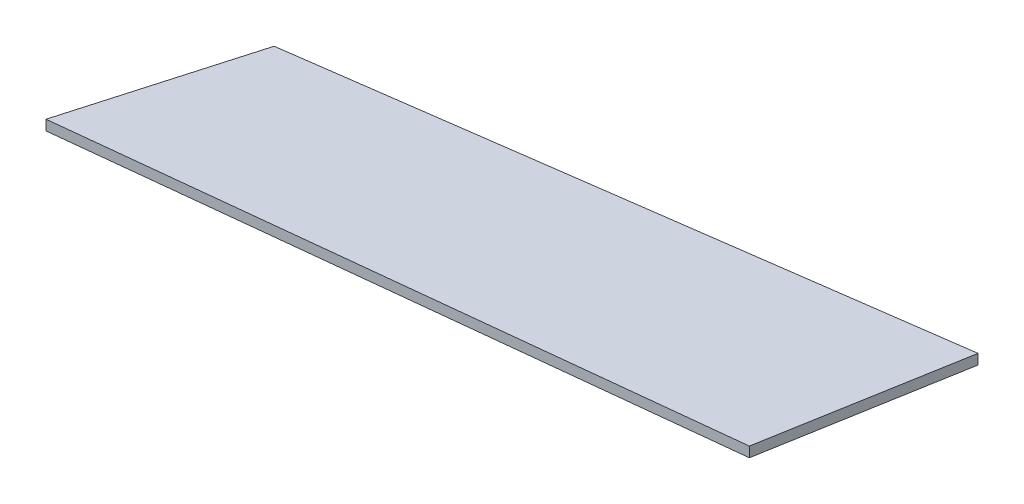
ISO-10303-21;
HEADER;
FILE_DESCRIPTION(('STEP AP214'),'2;1');
FILE_NAME('part.step','',(''),(''),'','','');
FILE_SCHEMA(('AUTOMOTIVE_DESIGN { 1 0 10303 214 1 1 1 1 }'));
ENDSEC;
DATA;
#1=APPLICATION_CONTEXT('core data for automotive mechanical design processes');
#2=APPLICATION_PROTOCOL_DEFINITION('international standard','automotive_design',2000,#1);
#3=PRODUCT_CONTEXT('',#1,'mechanical');
#4=PRODUCT('Part','Part','',(#3));
#5=PRODUCT_RELATED_PRODUCT_CATEGORY('part','',(#4));
#6=PRODUCT_DEFINITION_FORMATION('','',#4);
#7=PRODUCT_DEFINITION_CONTEXT('part definition',#1,'design');
#8=PRODUCT_DEFINITION('design','',#6,#7);
#9=PRODUCT_DEFINITION_SHAPE('','',#8);
#10=(LENGTH_UNIT() NAMED_UNIT(*) SI_UNIT(.MILLI.,.METRE.));
#11=(NAMED_UNIT(*) PLANE_ANGLE_UNIT() SI_UNIT($,.RADIAN.));
#12=(NAMED_UNIT(*) SI_UNIT($,.STERADIAN.) SOLID_ANGLE_UNIT());
#13=UNCERTAINTY_MEASURE_WITH_UNIT(LENGTH_MEASURE(1.E-05),#10,'distance_accuracy_value','');
#14=(GEOMETRIC_REPRESENTATION_CONTEXT(3) GLOBAL_UNCERTAINTY_ASSIGNED_CONTEXT((#13)) GLOBAL_UNIT_ASSIGNED_CONTEXT((#10,
#11,#12)) REPRESENTATION_CONTEXT('',''));
#15=CARTESIAN_POINT('',(0.,0.,0.));
#16=DIRECTION('',(0.,0.,1.));
#17=DIRECTION('',(1.,0.,0.));
#18=AXIS2_PLACEMENT_3D('',#15,#16,#17);
#19=CARTESIAN_POINT('',(125.174664551294,2.,-13.5343617383659));
#20=DIRECTION('',(-0.985045067285185,0.,-0.172296881623332));
#21=DIRECTION('',(-0.172296881623332,0.,0.985045067285185));
#22=AXIS2_PLACEMENT_3D('',#19,#20,#21);
#23=PLANE('',#22);
#24=DIRECTION('',(0.172296881623332,0.,-0.985045067285185));
#25=VECTOR('',#24,1.);
#26=CARTESIAN_POINT('',(125.174664551294,0.,-13.5343617383659));
#27=LINE('',#26,#25);
#28=CARTESIAN_POINT('',(125.174664551294,0.,-13.5343617383659));
#29=VERTEX_POINT('',#28);
#30=CARTESIAN_POINT('',(131.887717179775,0.,-51.9138107208871));
#31=VERTEX_POINT('',#30);
#32=EDGE_CURVE('E107',#29,#31,#27,.T.);
#33=ORIENTED_EDGE('',*,*,#32,.T.);
#34=DIRECTION('',(0.,-1.,0.));
#35=VECTOR('',#34,1.);
#36=CARTESIAN_POINT('',(131.887717179775,2.,-51.9138107208871));
#37=LINE('',#36,#35);
#38=CARTESIAN_POINT('',(131.887717179775,2.,-51.9138107208871));
#39=VERTEX_POINT('',#38);
#40=EDGE_CURVE('E11',#39,#31,#37,.T.);
#41=ORIENTED_EDGE('',*,*,#40,.F.);
#42=DIRECTION('',(0.172296881623332,0.,-0.985045067285185));
#43=VECTOR('',#42,1.);
#44=CARTESIAN_POINT('',(125.174664551294,2.,-13.5343617383659));
#45=LINE('',#44,#43);
#46=CARTESIAN_POINT('',(125.174664551294,2.,-13.5343617383659));
#47=VERTEX_POINT('',#46);
#48=EDGE_CURVE('E91',#47,#39,#45,.T.);
#49=ORIENTED_EDGE('',*,*,#48,.F.);
#50=DIRECTION('',(0.,-1.,0.));
#51=VECTOR('',#50,1.);
#52=CARTESIAN_POINT('',(125.174664551294,2.,-13.5343617383659));
#53=LINE('',#52,#51);
#54=EDGE_CURVE('E103',#47,#29,#53,.T.);
#55=ORIENTED_EDGE('',*,*,#54,.T.);
#56=EDGE_LOOP('',(#33,#41,#49,#55));
#57=FACE_BOUND('',#56,.T.);
#58=ADVANCED_FACE('F39',(#57),#23,.F.);
#59=CARTESIAN_POINT('',(131.887717179775,2.,-51.9138107208871));
#60=DIRECTION('',(0.13780006776538,0.,0.990460065486669));
#61=DIRECTION('',(0.990460065486669,0.,-0.13780006776538));
#62=AXIS2_PLACEMENT_3D('',#59,#60,#61);
#63=PLANE('',#62);
#64=DIRECTION('',(-0.990460065486669,0.,0.13780006776538));
#65=VECTOR('',#64,1.);
#66=CARTESIAN_POINT('',(131.887717179775,0.,-51.9138107208871));
#67=LINE('',#66,#65);
#68=CARTESIAN_POINT('',(10.0232622830181,0.,-34.9591340730074));
#69=VERTEX_POINT('',#68);
#70=EDGE_CURVE('E96',#31,#69,#67,.T.);
#71=ORIENTED_EDGE('',*,*,#70,.T.);
#72=DIRECTION('',(0.,-1.,0.));
#73=VECTOR('',#72,1.);
#74=CARTESIAN_POINT('',(10.0232622830181,2.,-34.9591340730074));
#75=LINE('',#74,#73);
#76=CARTESIAN_POINT('',(10.0232622830181,2.,-34.9591340730074));
#77=VERTEX_POINT('',#76);
#78=EDGE_CURVE('E48',#77,#69,#75,.T.);
#79=ORIENTED_EDGE('',*,*,#78,.F.);
#80=DIRECTION('',(-0.990460065486669,0.,0.13780006776538));
#81=VECTOR('',#80,1.);
#82=CARTESIAN_POINT('',(131.887717179775,2.,-51.9138107208871));
#83=LINE('',#82,#81);
#84=EDGE_CURVE('E86',#39,#77,#83,.T.);
#85=ORIENTED_EDGE('',*,*,#84,.F.);
#86=ORIENTED_EDGE('',*,*,#40,.T.);
#87=EDGE_LOOP('',(#71,#79,#85,#86));
#88=FACE_BOUND('',#87,.T.);
#89=ADVANCED_FACE('F95',(#88),#63,.F.);
#90=CARTESIAN_POINT('',(10.0232622830181,2.,-34.9591340730074));
#91=DIRECTION('',(0.961269768699399,0.,0.275609201197282));
#92=DIRECTION('',(0.275609201197282,0.,-0.961269768699399));
#93=AXIS2_PLACEMENT_3D('',#90,#91,#92);
#94=PLANE('',#93);
#95=DIRECTION('',(-0.275609201197282,0.,0.961269768699399));
#96=VECTOR('',#95,1.);
#97=CARTESIAN_POINT('',(10.0232622830181,0.,-34.9591340730074));
#98=LINE('',#97,#96);
#99=CARTESIAN_POINT('',(0.,0.,0.));
#100=VERTEX_POINT('',#99);
#101=EDGE_CURVE('E73',#69,#100,#98,.T.);
#102=ORIENTED_EDGE('',*,*,#101,.T.);
#103=DIRECTION('',(0.,-1.,0.));
#104=VECTOR('',#103,1.);
#105=CARTESIAN_POINT('',(0.,2.,0.));
#106=LINE('',#105,#104);
#107=CARTESIAN_POINT('',(0.,2.,0.));
#108=VERTEX_POINT('',#107);
#109=EDGE_CURVE('E98',#108,#100,#106,.T.);
#110=ORIENTED_EDGE('',*,*,#109,.F.);
#111=DIRECTION('',(-0.275609201197282,0.,0.961269768699399));
#112=VECTOR('',#111,1.);
#113=CARTESIAN_POINT('',(10.0232622830181,2.,-34.9591340730074));
#114=LINE('',#113,#112);
#115=EDGE_CURVE('E89',#77,#108,#114,.T.);
#116=ORIENTED_EDGE('',*,*,#115,.F.);
#117=ORIENTED_EDGE('',*,*,#78,.T.);
#118=EDGE_LOOP('',(#102,#110,#116,#117));
#119=FACE_BOUND('',#118,.T.);
#120=ADVANCED_FACE('F99',(#119),#94,.F.);
#121=CARTESIAN_POINT('',(0.,2.,0.));
#122=DIRECTION('',(-0.107497274249134,0.,-0.994205379199392));
#123=DIRECTION('',(-0.994205379199392,0.,0.107497274249134));
#124=AXIS2_PLACEMENT_3D('',#121,#122,#123);
#125=PLANE('',#124);
#126=DIRECTION('',(0.994205379199392,0.,-0.107497274249134));
#127=VECTOR('',#126,1.);
#128=CARTESIAN_POINT('',(0.,0.,0.));
#129=LINE('',#128,#127);
#130=EDGE_CURVE('E79',#100,#29,#129,.T.);
#131=ORIENTED_EDGE('',*,*,#130,.T.);
#132=ORIENTED_EDGE('',*,*,#54,.F.);
#133=DIRECTION('',(0.994205379199392,0.,-0.107497274249134));
#134=VECTOR('',#133,1.);
#135=CARTESIAN_POINT('',(0.,2.,0.));
#136=LINE('',#135,#134);
#137=EDGE_CURVE('E56',#108,#47,#136,.T.);
#138=ORIENTED_EDGE('',*,*,#137,.F.);
#139=ORIENTED_EDGE('',*,*,#109,.T.);
#140=EDGE_LOOP('',(#131,#132,#138,#139));
#141=FACE_BOUND('',#140,.T.);
#142=ADVANCED_FACE('F120',(#141),#125,.F.);
#143=CARTESIAN_POINT('',(0.,2.,0.));
#144=DIRECTION('',(0.,-1.,0.));
#145=DIRECTION('',(0.,0.,-1.));
#146=AXIS2_PLACEMENT_3D('',#143,#144,#145);
#147=PLANE('',#146);
#148=ORIENTED_EDGE('',*,*,#48,.T.);
#149=ORIENTED_EDGE('',*,*,#84,.T.);
#150=ORIENTED_EDGE('',*,*,#115,.T.);
#151=ORIENTED_EDGE('',*,*,#137,.T.);
#152=EDGE_LOOP('',(#148,#149,#150,#151));
#153=FACE_BOUND('',#152,.T.);
#154=ADVANCED_FACE('F87',(#153),#147,.F.);
#155=CARTESIAN_POINT('',(0.,0.,0.));
#156=DIRECTION('',(0.,-1.,0.));
#157=DIRECTION('',(0.,0.,-1.));
#158=AXIS2_PLACEMENT_3D('',#155,#156,#157);
#159=PLANE('',#158);
#160=ORIENTED_EDGE('',*,*,#32,.F.);
#161=ORIENTED_EDGE('',*,*,#130,.F.);
#162=ORIENTED_EDGE('',*,*,#101,.F.);
#163=ORIENTED_EDGE('',*,*,#70,.F.);
#164=EDGE_LOOP('',(#160,#161,#162,#163));
#165=FACE_BOUND('',#164,.T.);
#166=ADVANCED_FACE('F123',(#165),#159,.T.);
#167=CLOSED_SHELL('',(#58,#89,#120,#142,#154,#166));
#168=MANIFOLD_SOLID_BREP('B2',#167);
#169=ADVANCED_BREP_SHAPE_REPRESENTATION('',(#18,#168),#14);
#170=SHAPE_DEFINITION_REPRESENTATION(#9,#169);
ENDSEC;
END-ISO-10303-21;
